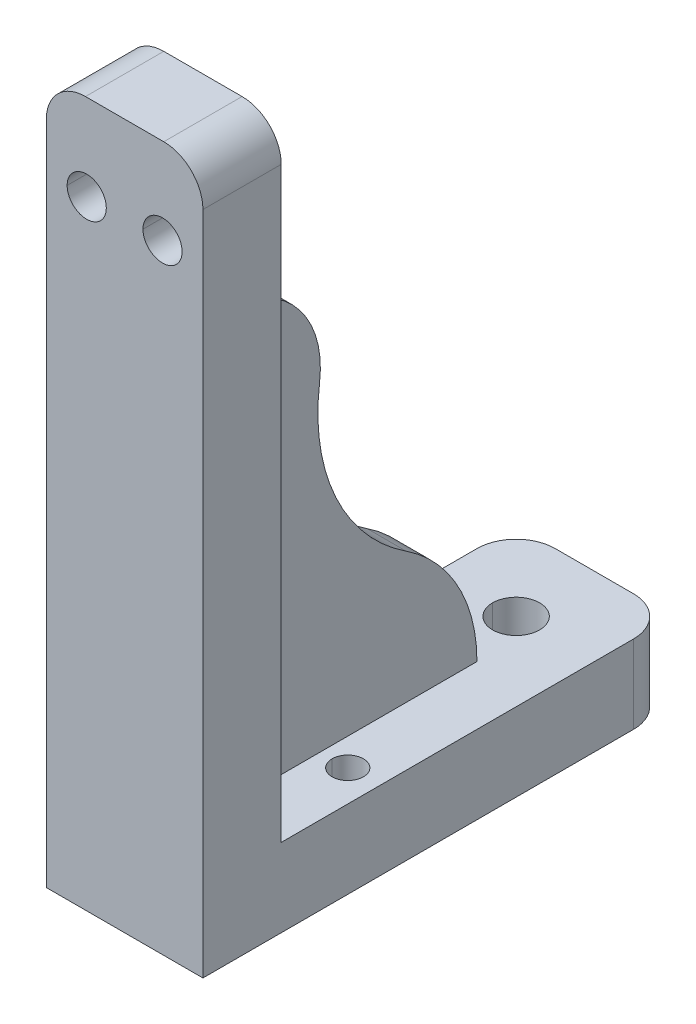
ISO-10303-21;
HEADER;
FILE_DESCRIPTION(('STEP AP214'),'2;1');
FILE_NAME('part.step','',(''),(''),'','','');
FILE_SCHEMA(('AUTOMOTIVE_DESIGN { 1 0 10303 214 1 1 1 1 }'));
ENDSEC;
DATA;
#1=APPLICATION_CONTEXT('core data for automotive mechanical design processes');
#2=APPLICATION_PROTOCOL_DEFINITION('international standard','automotive_design',2000,#1);
#3=PRODUCT_CONTEXT('',#1,'mechanical');
#4=PRODUCT('Part','Part','',(#3));
#5=PRODUCT_RELATED_PRODUCT_CATEGORY('part','',(#4));
#6=PRODUCT_DEFINITION_FORMATION('','',#4);
#7=PRODUCT_DEFINITION_CONTEXT('part definition',#1,'design');
#8=PRODUCT_DEFINITION('design','',#6,#7);
#9=PRODUCT_DEFINITION_SHAPE('','',#8);
#10=(LENGTH_UNIT() NAMED_UNIT(*) SI_UNIT(.MILLI.,.METRE.));
#11=(NAMED_UNIT(*) PLANE_ANGLE_UNIT() SI_UNIT($,.RADIAN.));
#12=(NAMED_UNIT(*) SI_UNIT($,.STERADIAN.) SOLID_ANGLE_UNIT());
#13=UNCERTAINTY_MEASURE_WITH_UNIT(LENGTH_MEASURE(1.E-05),#10,'distance_accuracy_value','');
#14=(GEOMETRIC_REPRESENTATION_CONTEXT(3) GLOBAL_UNCERTAINTY_ASSIGNED_CONTEXT((#13)) GLOBAL_UNIT_ASSIGNED_CONTEXT((#10,
#11,#12)) REPRESENTATION_CONTEXT('',''));
#15=CARTESIAN_POINT('',(0.,0.,0.));
#16=DIRECTION('',(0.,0.,1.));
#17=DIRECTION('',(1.,0.,0.));
#18=AXIS2_PLACEMENT_3D('',#15,#16,#17);
#19=CARTESIAN_POINT('',(20.,0.,0.));
#20=DIRECTION('',(1.,0.,0.));
#21=DIRECTION('',(0.,1.,0.));
#22=AXIS2_PLACEMENT_3D('',#19,#20,#21);
#23=PLANE('',#22);
#24=DIRECTION('',(0.,-1.,0.));
#25=VECTOR('',#24,1.);
#26=CARTESIAN_POINT('',(20.,85.,120.));
#27=LINE('',#26,#25);
#28=CARTESIAN_POINT('',(20.,170.,120.));
#29=VERTEX_POINT('',#28);
#30=CARTESIAN_POINT('',(20.,0.,120.));
#31=VERTEX_POINT('',#30);
#32=EDGE_CURVE('E278',#29,#31,#27,.T.);
#33=ORIENTED_EDGE('',*,*,#32,.T.);
#34=DIRECTION('',(0.,0.,-1.));
#35=VECTOR('',#34,1.);
#36=CARTESIAN_POINT('',(20.,0.,65.));
#37=LINE('',#36,#35);
#38=CARTESIAN_POINT('',(20.,0.,10.));
#39=VERTEX_POINT('',#38);
#40=EDGE_CURVE('E403',#31,#39,#37,.T.);
#41=ORIENTED_EDGE('',*,*,#40,.T.);
#42=DIRECTION('',(0.,1.,0.));
#43=VECTOR('',#42,1.);
#44=CARTESIAN_POINT('',(20.,90.,10.));
#45=LINE('',#44,#43);
#46=CARTESIAN_POINT('',(20.,20.,10.));
#47=VERTEX_POINT('',#46);
#48=EDGE_CURVE('E357',#39,#47,#45,.T.);
#49=ORIENTED_EDGE('',*,*,#48,.T.);
#50=DIRECTION('',(0.,0.,1.));
#51=VECTOR('',#50,1.);
#52=CARTESIAN_POINT('',(20.,20.,55.));
#53=LINE('',#52,#51);
#54=CARTESIAN_POINT('',(20.,20.,100.));
#55=VERTEX_POINT('',#54);
#56=EDGE_CURVE('E37',#47,#55,#53,.T.);
#57=ORIENTED_EDGE('',*,*,#56,.T.);
#58=DIRECTION('',(0.,1.,0.));
#59=VECTOR('',#58,1.);
#60=CARTESIAN_POINT('',(20.,95.,100.));
#61=LINE('',#60,#59);
#62=CARTESIAN_POINT('',(20.,170.,100.));
#63=VERTEX_POINT('',#62);
#64=EDGE_CURVE('E286',#55,#63,#61,.T.);
#65=ORIENTED_EDGE('',*,*,#64,.T.);
#66=DIRECTION('',(0.,0.,1.));
#67=VECTOR('',#66,1.);
#68=CARTESIAN_POINT('',(20.,170.,65.));
#69=LINE('',#68,#67);
#70=EDGE_CURVE('E10',#63,#29,#69,.T.);
#71=ORIENTED_EDGE('',*,*,#70,.T.);
#72=EDGE_LOOP('',(#33,#41,#49,#57,#65,#71));
#73=FACE_BOUND('',#72,.T.);
#74=ADVANCED_FACE('F17',(#73),#23,.T.);
#75=CARTESIAN_POINT('',(10.,170.,65.));
#76=DIRECTION('',(0.,0.,1.));
#77=DIRECTION('',(1.,0.,0.));
#78=AXIS2_PLACEMENT_3D('',#75,#76,#77);
#79=CYLINDRICAL_SURFACE('',#78,10.);
#80=CARTESIAN_POINT('',(10.,170.,120.));
#81=DIRECTION('',(0.,0.,-1.));
#82=DIRECTION('',(1.,0.,0.));
#83=AXIS2_PLACEMENT_3D('',#80,#81,#82);
#84=CIRCLE('',#83,10.);
#85=CARTESIAN_POINT('',(10.,180.,120.));
#86=VERTEX_POINT('',#85);
#87=EDGE_CURVE('E276',#86,#29,#84,.T.);
#88=ORIENTED_EDGE('',*,*,#87,.T.);
#89=ORIENTED_EDGE('',*,*,#70,.F.);
#90=CARTESIAN_POINT('',(10.,170.,100.));
#91=DIRECTION('',(0.,0.,1.));
#92=DIRECTION('',(1.,0.,0.));
#93=AXIS2_PLACEMENT_3D('',#90,#91,#92);
#94=CIRCLE('',#93,10.);
#95=CARTESIAN_POINT('',(10.,180.,100.));
#96=VERTEX_POINT('',#95);
#97=EDGE_CURVE('E291',#63,#96,#94,.T.);
#98=ORIENTED_EDGE('',*,*,#97,.T.);
#99=DIRECTION('',(0.,0.,1.));
#100=VECTOR('',#99,1.);
#101=CARTESIAN_POINT('',(10.,180.,110.));
#102=LINE('',#101,#100);
#103=EDGE_CURVE('E25',#96,#86,#102,.T.);
#104=ORIENTED_EDGE('',*,*,#103,.T.);
#105=EDGE_LOOP('',(#88,#89,#98,#104));
#106=FACE_BOUND('',#105,.T.);
#107=ADVANCED_FACE('F526',(#106),#79,.T.);
#108=CARTESIAN_POINT('',(0.,180.,100.));
#109=DIRECTION('',(0.,1.,0.));
#110=DIRECTION('',(1.,0.,0.));
#111=AXIS2_PLACEMENT_3D('',#108,#109,#110);
#112=PLANE('',#111);
#113=DIRECTION('',(1.,0.,0.));
#114=VECTOR('',#113,1.);
#115=CARTESIAN_POINT('',(0.,180.,120.));
#116=LINE('',#115,#114);
#117=CARTESIAN_POINT('',(-10.,180.,120.));
#118=VERTEX_POINT('',#117);
#119=EDGE_CURVE('E270',#118,#86,#116,.T.);
#120=ORIENTED_EDGE('',*,*,#119,.T.);
#121=ORIENTED_EDGE('',*,*,#103,.F.);
#122=DIRECTION('',(1.,0.,0.));
#123=VECTOR('',#122,1.);
#124=CARTESIAN_POINT('',(0.,180.,100.));
#125=LINE('',#124,#123);
#126=CARTESIAN_POINT('',(-10.,180.,100.));
#127=VERTEX_POINT('',#126);
#128=EDGE_CURVE('E258',#127,#96,#125,.T.);
#129=ORIENTED_EDGE('',*,*,#128,.F.);
#130=DIRECTION('',(0.,0.,1.));
#131=VECTOR('',#130,1.);
#132=CARTESIAN_POINT('',(-10.,180.,65.));
#133=LINE('',#132,#131);
#134=EDGE_CURVE('E250',#127,#118,#133,.T.);
#135=ORIENTED_EDGE('',*,*,#134,.T.);
#136=EDGE_LOOP('',(#120,#121,#129,#135));
#137=FACE_BOUND('',#136,.T.);
#138=ADVANCED_FACE('F523',(#137),#112,.T.);
#139=CARTESIAN_POINT('',(-10.,170.,65.));
#140=DIRECTION('',(0.,0.,1.));
#141=DIRECTION('',(0.,1.,0.));
#142=AXIS2_PLACEMENT_3D('',#139,#140,#141);
#143=CYLINDRICAL_SURFACE('',#142,10.);
#144=CARTESIAN_POINT('',(-10.,170.,120.));
#145=DIRECTION('',(0.,0.,-1.));
#146=DIRECTION('',(1.,0.,0.));
#147=AXIS2_PLACEMENT_3D('',#144,#145,#146);
#148=CIRCLE('',#147,10.);
#149=CARTESIAN_POINT('',(-20.,170.,120.));
#150=VERTEX_POINT('',#149);
#151=EDGE_CURVE('E263',#150,#118,#148,.T.);
#152=ORIENTED_EDGE('',*,*,#151,.T.);
#153=ORIENTED_EDGE('',*,*,#134,.F.);
#154=CARTESIAN_POINT('',(-10.,170.,100.));
#155=DIRECTION('',(0.,0.,1.));
#156=DIRECTION('',(1.,0.,0.));
#157=AXIS2_PLACEMENT_3D('',#154,#155,#156);
#158=CIRCLE('',#157,10.);
#159=CARTESIAN_POINT('',(-20.,170.,100.));
#160=VERTEX_POINT('',#159);
#161=EDGE_CURVE('E342',#127,#160,#158,.T.);
#162=ORIENTED_EDGE('',*,*,#161,.T.);
#163=DIRECTION('',(0.,0.,1.));
#164=VECTOR('',#163,1.);
#165=CARTESIAN_POINT('',(-20.,170.,110.));
#166=LINE('',#165,#164);
#167=EDGE_CURVE('E363',#160,#150,#166,.T.);
#168=ORIENTED_EDGE('',*,*,#167,.T.);
#169=EDGE_LOOP('',(#152,#153,#162,#168));
#170=FACE_BOUND('',#169,.T.);
#171=ADVANCED_FACE('F555',(#170),#143,.T.);
#172=CARTESIAN_POINT('',(-9.68416595459,158.,59.3399999982));
#173=DIRECTION('',(0.,0.,1.));
#174=DIRECTION('',(1.,0.,0.));
#175=AXIS2_PLACEMENT_3D('',#172,#173,#174);
#176=CYLINDRICAL_SURFACE('',#175,5.);
#177=CARTESIAN_POINT('',(-9.68416595459,158.,100.));
#178=DIRECTION('',(0.,0.,-1.));
#179=DIRECTION('',(1.,0.,0.));
#180=AXIS2_PLACEMENT_3D('',#177,#178,#179);
#181=CIRCLE('',#180,5.);
#182=CARTESIAN_POINT('',(-14.6841659546,158.,100.));
#183=VERTEX_POINT('',#182);
#184=CARTESIAN_POINT('',(-4.68416595459,158.,100.));
#185=VERTEX_POINT('',#184);
#186=EDGE_CURVE('E245',#183,#185,#181,.T.);
#187=ORIENTED_EDGE('',*,*,#186,.T.);
#188=DIRECTION('',(0.,0.,-1.));
#189=VECTOR('',#188,1.);
#190=CARTESIAN_POINT('',(-4.68416595459,158.,59.3399999982));
#191=LINE('',#190,#189);
#192=CARTESIAN_POINT('',(-4.68416595459,158.,120.));
#193=VERTEX_POINT('',#192);
#194=EDGE_CURVE('E239',#193,#185,#191,.T.);
#195=ORIENTED_EDGE('',*,*,#194,.F.);
#196=CARTESIAN_POINT('',(-9.68416595459,158.,120.));
#197=DIRECTION('',(0.,0.,1.));
#198=DIRECTION('',(1.,0.,0.));
#199=AXIS2_PLACEMENT_3D('',#196,#197,#198);
#200=CIRCLE('',#199,5.);
#201=CARTESIAN_POINT('',(-14.6841659546,158.,120.));
#202=VERTEX_POINT('',#201);
#203=EDGE_CURVE('E243',#193,#202,#200,.T.);
#204=ORIENTED_EDGE('',*,*,#203,.T.);
#205=DIRECTION('',(0.,0.,-1.));
#206=VECTOR('',#205,1.);
#207=CARTESIAN_POINT('',(-14.6841659546,158.,59.3399999982));
#208=LINE('',#207,#206);
#209=EDGE_CURVE('E251',#202,#183,#208,.T.);
#210=ORIENTED_EDGE('',*,*,#209,.T.);
#211=EDGE_LOOP('',(#187,#195,#204,#210));
#212=FACE_BOUND('',#211,.T.);
#213=ADVANCED_FACE('F241',(#212),#176,.F.);
#214=CARTESIAN_POINT('',(-9.68416595459,158.,59.3399999982));
#215=DIRECTION('',(0.,0.,1.));
#216=DIRECTION('',(1.,0.,0.));
#217=AXIS2_PLACEMENT_3D('',#214,#215,#216);
#218=CYLINDRICAL_SURFACE('',#217,5.);
#219=CARTESIAN_POINT('',(-9.68416595459,158.,100.));
#220=DIRECTION('',(0.,0.,-1.));
#221=DIRECTION('',(1.,0.,0.));
#222=AXIS2_PLACEMENT_3D('',#219,#220,#221);
#223=CIRCLE('',#222,5.);
#224=EDGE_CURVE('E356',#185,#183,#223,.T.);
#225=ORIENTED_EDGE('',*,*,#224,.T.);
#226=ORIENTED_EDGE('',*,*,#209,.F.);
#227=CARTESIAN_POINT('',(-9.68416595459,158.,120.));
#228=DIRECTION('',(0.,0.,1.));
#229=DIRECTION('',(1.,0.,0.));
#230=AXIS2_PLACEMENT_3D('',#227,#228,#229);
#231=CIRCLE('',#230,5.);
#232=EDGE_CURVE('E254',#202,#193,#231,.T.);
#233=ORIENTED_EDGE('',*,*,#232,.T.);
#234=ORIENTED_EDGE('',*,*,#194,.T.);
#235=EDGE_LOOP('',(#225,#226,#233,#234));
#236=FACE_BOUND('',#235,.T.);
#237=ADVANCED_FACE('F255',(#236),#218,.F.);
#238=CARTESIAN_POINT('',(0.,20.,0.));
#239=DIRECTION('',(0.,1.,0.));
#240=DIRECTION('',(1.,0.,0.));
#241=AXIS2_PLACEMENT_3D('',#238,#239,#240);
#242=PLANE('',#241);
#243=CARTESIAN_POINT('',(-12.,20.,75.));
#244=DIRECTION('',(0.,1.,0.));
#245=DIRECTION('',(1.,0.,0.));
#246=AXIS2_PLACEMENT_3D('',#243,#244,#245);
#247=CIRCLE('',#246,4.);
#248=CARTESIAN_POINT('',(-16.,20.,75.));
#249=VERTEX_POINT('',#248);
#250=CARTESIAN_POINT('',(-8.,20.,75.));
#251=VERTEX_POINT('',#250);
#252=EDGE_CURVE('E316',#249,#251,#247,.T.);
#253=ORIENTED_EDGE('',*,*,#252,.F.);
#254=CARTESIAN_POINT('',(-12.,20.,75.));
#255=DIRECTION('',(0.,1.,0.));
#256=DIRECTION('',(1.,0.,0.));
#257=AXIS2_PLACEMENT_3D('',#254,#255,#256);
#258=CIRCLE('',#257,4.);
#259=EDGE_CURVE('E292',#251,#249,#258,.T.);
#260=ORIENTED_EDGE('',*,*,#259,.F.);
#261=EDGE_LOOP('',(#253,#260));
#262=FACE_BOUND('',#261,.T.);
#263=CARTESIAN_POINT('',(12.,20.,75.));
#264=DIRECTION('',(0.,1.,0.));
#265=DIRECTION('',(1.,0.,0.));
#266=AXIS2_PLACEMENT_3D('',#263,#264,#265);
#267=CIRCLE('',#266,4.);
#268=CARTESIAN_POINT('',(8.,20.,75.));
#269=VERTEX_POINT('',#268);
#270=CARTESIAN_POINT('',(16.,20.,75.));
#271=VERTEX_POINT('',#270);
#272=EDGE_CURVE('E341',#269,#271,#267,.T.);
#273=ORIENTED_EDGE('',*,*,#272,.F.);
#274=CARTESIAN_POINT('',(12.,20.,75.));
#275=DIRECTION('',(0.,1.,0.));
#276=DIRECTION('',(1.,0.,0.));
#277=AXIS2_PLACEMENT_3D('',#274,#275,#276);
#278=CIRCLE('',#277,4.);
#279=EDGE_CURVE('E430',#271,#269,#278,.T.);
#280=ORIENTED_EDGE('',*,*,#279,.F.);
#281=EDGE_LOOP('',(#273,#280));
#282=FACE_BOUND('',#281,.T.);
#283=CARTESIAN_POINT('',(0.,20.,20.));
#284=DIRECTION('',(0.,1.,0.));
#285=DIRECTION('',(1.,0.,0.));
#286=AXIS2_PLACEMENT_3D('',#283,#284,#285);
#287=CIRCLE('',#286,6.);
#288=CARTESIAN_POINT('',(-6.,20.,20.));
#289=VERTEX_POINT('',#288);
#290=CARTESIAN_POINT('',(6.,20.,20.));
#291=VERTEX_POINT('',#290);
#292=EDGE_CURVE('E46',#289,#291,#287,.T.);
#293=ORIENTED_EDGE('',*,*,#292,.F.);
#294=CARTESIAN_POINT('',(0.,20.,20.));
#295=DIRECTION('',(0.,1.,0.));
#296=DIRECTION('',(1.,0.,0.));
#297=AXIS2_PLACEMENT_3D('',#294,#295,#296);
#298=CIRCLE('',#297,6.);
#299=EDGE_CURVE('E340',#291,#289,#298,.T.);
#300=ORIENTED_EDGE('',*,*,#299,.F.);
#301=EDGE_LOOP('',(#293,#300));
#302=FACE_BOUND('',#301,.T.);
#303=DIRECTION('',(0.,0.,1.));
#304=VECTOR('',#303,1.);
#305=CARTESIAN_POINT('',(-20.,20.,55.));
#306=LINE('',#305,#304);
#307=CARTESIAN_POINT('',(-20.,20.,10.));
#308=VERTEX_POINT('',#307);
#309=CARTESIAN_POINT('',(-20.,20.,100.));
#310=VERTEX_POINT('',#309);
#311=EDGE_CURVE('E368',#308,#310,#306,.T.);
#312=ORIENTED_EDGE('',*,*,#311,.T.);
#313=DIRECTION('',(1.,0.,0.));
#314=VECTOR('',#313,1.);
#315=CARTESIAN_POINT('',(-12.5,20.,100.));
#316=LINE('',#315,#314);
#317=CARTESIAN_POINT('',(-5.,20.,100.));
#318=VERTEX_POINT('',#317);
#319=EDGE_CURVE('E332',#310,#318,#316,.T.);
#320=ORIENTED_EDGE('',*,*,#319,.T.);
#321=DIRECTION('',(0.,0.,-1.));
#322=VECTOR('',#321,1.);
#323=CARTESIAN_POINT('',(-5.,20.,67.5));
#324=LINE('',#323,#322);
#325=CARTESIAN_POINT('',(-5.,20.,35.));
#326=VERTEX_POINT('',#325);
#327=EDGE_CURVE('E399',#318,#326,#324,.T.);
#328=ORIENTED_EDGE('',*,*,#327,.T.);
#329=DIRECTION('',(1.,0.,0.));
#330=VECTOR('',#329,1.);
#331=CARTESIAN_POINT('',(0.,20.,35.));
#332=LINE('',#331,#330);
#333=CARTESIAN_POINT('',(5.,20.,35.));
#334=VERTEX_POINT('',#333);
#335=EDGE_CURVE('E390',#326,#334,#332,.T.);
#336=ORIENTED_EDGE('',*,*,#335,.T.);
#337=DIRECTION('',(0.,0.,-1.));
#338=VECTOR('',#337,1.);
#339=CARTESIAN_POINT('',(5.,20.,67.5));
#340=LINE('',#339,#338);
#341=CARTESIAN_POINT('',(5.,20.,100.));
#342=VERTEX_POINT('',#341);
#343=EDGE_CURVE('E314',#342,#334,#340,.T.);
#344=ORIENTED_EDGE('',*,*,#343,.F.);
#345=DIRECTION('',(1.,0.,0.));
#346=VECTOR('',#345,1.);
#347=CARTESIAN_POINT('',(12.5,20.,100.));
#348=LINE('',#347,#346);
#349=EDGE_CURVE('E290',#342,#55,#348,.T.);
#350=ORIENTED_EDGE('',*,*,#349,.T.);
#351=ORIENTED_EDGE('',*,*,#56,.F.);
#352=CARTESIAN_POINT('',(10.,20.,10.));
#353=DIRECTION('',(0.,-1.,0.));
#354=DIRECTION('',(1.,0.,0.));
#355=AXIS2_PLACEMENT_3D('',#352,#353,#354);
#356=CIRCLE('',#355,10.);
#357=CARTESIAN_POINT('',(10.,20.,0.));
#358=VERTEX_POINT('',#357);
#359=EDGE_CURVE('E360',#358,#47,#356,.T.);
#360=ORIENTED_EDGE('',*,*,#359,.F.);
#361=DIRECTION('',(1.,0.,0.));
#362=VECTOR('',#361,1.);
#363=CARTESIAN_POINT('',(0.,20.,0.));
#364=LINE('',#363,#362);
#365=CARTESIAN_POINT('',(-10.,20.,0.));
#366=VERTEX_POINT('',#365);
#367=EDGE_CURVE('E280',#366,#358,#364,.T.);
#368=ORIENTED_EDGE('',*,*,#367,.F.);
#369=CARTESIAN_POINT('',(-10.,20.,10.));
#370=DIRECTION('',(0.,-1.,0.));
#371=DIRECTION('',(1.,0.,0.));
#372=AXIS2_PLACEMENT_3D('',#369,#370,#371);
#373=CIRCLE('',#372,10.);
#374=EDGE_CURVE('E315',#308,#366,#373,.T.);
#375=ORIENTED_EDGE('',*,*,#374,.F.);
#376=EDGE_LOOP('',(#312,#320,#328,#336,#344,#350,#351,#360,#368,#375));
#377=FACE_BOUND('',#376,.T.);
#378=ADVANCED_FACE('F532',(#262,#282,#302,#377),#242,.T.);
#379=CARTESIAN_POINT('',(5.,0.,0.));
#380=DIRECTION('',(1.,0.,0.));
#381=DIRECTION('',(0.,1.,0.));
#382=AXIS2_PLACEMENT_3D('',#379,#380,#381);
#383=PLANE('',#382);
#384=CARTESIAN_POINT('',(5.,20.,75.));
#385=DIRECTION('',(1.,0.,0.));
#386=DIRECTION('',(0.,1.,0.));
#387=AXIS2_PLACEMENT_3D('',#384,#385,#386);
#388=CIRCLE('',#387,40.);
#389=CARTESIAN_POINT('',(5.,53.4462866508,53.0604031652));
#390=VERTEX_POINT('',#389);
#391=EDGE_CURVE('E394',#334,#390,#388,.T.);
#392=ORIENTED_EDGE('',*,*,#391,.T.);
#393=CARTESIAN_POINT('',(5.,95.2541449642,25.6359071216));
#394=DIRECTION('',(-1.,0.,0.));
#395=DIRECTION('',(0.,1.,0.));
#396=AXIS2_PLACEMENT_3D('',#393,#394,#395);
#397=CIRCLE('',#396,50.);
#398=CARTESIAN_POINT('',(5.,101.751381655,75.2119690405));
#399=VERTEX_POINT('',#398);
#400=EDGE_CURVE('E377',#390,#399,#397,.T.);
#401=ORIENTED_EDGE('',*,*,#400,.T.);
#402=CARTESIAN_POINT('',(5.,105.,100.));
#403=DIRECTION('',(1.,0.,0.));
#404=DIRECTION('',(0.,1.,0.));
#405=AXIS2_PLACEMENT_3D('',#402,#403,#404);
#406=CIRCLE('',#405,25.);
#407=CARTESIAN_POINT('',(5.,130.,100.));
#408=VERTEX_POINT('',#407);
#409=EDGE_CURVE('E311',#399,#408,#406,.T.);
#410=ORIENTED_EDGE('',*,*,#409,.T.);
#411=DIRECTION('',(0.,-1.,0.));
#412=VECTOR('',#411,1.);
#413=CARTESIAN_POINT('',(5.,75.,100.));
#414=LINE('',#413,#412);
#415=EDGE_CURVE('E306',#408,#342,#414,.T.);
#416=ORIENTED_EDGE('',*,*,#415,.T.);
#417=ORIENTED_EDGE('',*,*,#343,.T.);
#418=EDGE_LOOP('',(#392,#401,#410,#416,#417));
#419=FACE_BOUND('',#418,.T.);
#420=ADVANCED_FACE('F535',(#419),#383,.T.);
#421=CARTESIAN_POINT('',(0.,105.,100.));
#422=DIRECTION('',(1.,0.,0.));
#423=DIRECTION('',(0.,-0.129944733810026,-0.991521238378201));
#424=AXIS2_PLACEMENT_3D('',#421,#422,#423);
#425=CYLINDRICAL_SURFACE('',#424,25.);
#426=DIRECTION('',(1.,0.,0.));
#427=VECTOR('',#426,1.);
#428=CARTESIAN_POINT('',(0.,101.751381655,75.2119690405));
#429=LINE('',#428,#427);
#430=CARTESIAN_POINT('',(-5.,101.751381655,75.2119690405));
#431=VERTEX_POINT('',#430);
#432=EDGE_CURVE('E353',#431,#399,#429,.T.);
#433=ORIENTED_EDGE('',*,*,#432,.F.);
#434=CARTESIAN_POINT('',(-5.,105.,100.));
#435=DIRECTION('',(1.,0.,0.));
#436=DIRECTION('',(0.,1.,0.));
#437=AXIS2_PLACEMENT_3D('',#434,#435,#436);
#438=CIRCLE('',#437,25.);
#439=CARTESIAN_POINT('',(-5.,130.,100.));
#440=VERTEX_POINT('',#439);
#441=EDGE_CURVE('E395',#431,#440,#438,.T.);
#442=ORIENTED_EDGE('',*,*,#441,.T.);
#443=DIRECTION('',(1.,0.,0.));
#444=VECTOR('',#443,1.);
#445=CARTESIAN_POINT('',(0.,130.,100.));
#446=LINE('',#445,#444);
#447=EDGE_CURVE('E310',#440,#408,#446,.T.);
#448=ORIENTED_EDGE('',*,*,#447,.T.);
#449=ORIENTED_EDGE('',*,*,#409,.F.);
#450=EDGE_LOOP('',(#433,#442,#448,#449));
#451=FACE_BOUND('',#450,.T.);
#452=ADVANCED_FACE('F538',(#451),#425,.T.);
#453=CARTESIAN_POINT('',(-10.,90.,10.));
#454=DIRECTION('',(0.,1.,0.));
#455=DIRECTION('',(0.,0.,-1.));
#456=AXIS2_PLACEMENT_3D('',#453,#454,#455);
#457=CYLINDRICAL_SURFACE('',#456,10.);
#458=ORIENTED_EDGE('',*,*,#374,.T.);
#459=DIRECTION('',(0.,1.,0.));
#460=VECTOR('',#459,1.);
#461=CARTESIAN_POINT('',(-10.,10.,0.));
#462=LINE('',#461,#460);
#463=CARTESIAN_POINT('',(-10.,0.,0.));
#464=VERTEX_POINT('',#463);
#465=EDGE_CURVE('E274',#464,#366,#462,.T.);
#466=ORIENTED_EDGE('',*,*,#465,.F.);
#467=CARTESIAN_POINT('',(-10.,0.,10.));
#468=DIRECTION('',(0.,1.,0.));
#469=DIRECTION('',(1.,0.,0.));
#470=AXIS2_PLACEMENT_3D('',#467,#468,#469);
#471=CIRCLE('',#470,10.);
#472=CARTESIAN_POINT('',(-20.,0.,10.));
#473=VERTEX_POINT('',#472);
#474=EDGE_CURVE('E409',#464,#473,#471,.T.);
#475=ORIENTED_EDGE('',*,*,#474,.T.);
#476=DIRECTION('',(0.,1.,0.));
#477=VECTOR('',#476,1.);
#478=CARTESIAN_POINT('',(-20.,10.,10.));
#479=LINE('',#478,#477);
#480=EDGE_CURVE('E371',#473,#308,#479,.T.);
#481=ORIENTED_EDGE('',*,*,#480,.T.);
#482=EDGE_LOOP('',(#458,#466,#475,#481));
#483=FACE_BOUND('',#482,.T.);
#484=ADVANCED_FACE('F572',(#483),#457,.T.);
#485=CARTESIAN_POINT('',(10.,90.,10.));
#486=DIRECTION('',(0.,1.,0.));
#487=DIRECTION('',(1.,0.,0.));
#488=AXIS2_PLACEMENT_3D('',#485,#486,#487);
#489=CYLINDRICAL_SURFACE('',#488,10.);
#490=ORIENTED_EDGE('',*,*,#359,.T.);
#491=ORIENTED_EDGE('',*,*,#48,.F.);
#492=CARTESIAN_POINT('',(10.,0.,10.));
#493=DIRECTION('',(0.,1.,0.));
#494=DIRECTION('',(1.,0.,0.));
#495=AXIS2_PLACEMENT_3D('',#492,#493,#494);
#496=CIRCLE('',#495,10.);
#497=CARTESIAN_POINT('',(10.,0.,0.));
#498=VERTEX_POINT('',#497);
#499=EDGE_CURVE('E389',#39,#498,#496,.T.);
#500=ORIENTED_EDGE('',*,*,#499,.T.);
#501=DIRECTION('',(0.,1.,0.));
#502=VECTOR('',#501,1.);
#503=CARTESIAN_POINT('',(10.,10.,0.));
#504=LINE('',#503,#502);
#505=EDGE_CURVE('E284',#498,#358,#504,.T.);
#506=ORIENTED_EDGE('',*,*,#505,.T.);
#507=EDGE_LOOP('',(#490,#491,#500,#506));
#508=FACE_BOUND('',#507,.T.);
#509=ADVANCED_FACE('F564',(#508),#489,.T.);
#510=CARTESIAN_POINT('',(0.,9.33999999889,20.));
#511=DIRECTION('',(0.,1.,0.));
#512=DIRECTION('',(-1.,0.,0.));
#513=AXIS2_PLACEMENT_3D('',#510,#511,#512);
#514=CYLINDRICAL_SURFACE('',#513,6.);
#515=CARTESIAN_POINT('',(0.,0.,20.));
#516=DIRECTION('',(0.,-1.,0.));
#517=DIRECTION('',(1.,0.,0.));
#518=AXIS2_PLACEMENT_3D('',#515,#516,#517);
#519=CIRCLE('',#518,6.);
#520=CARTESIAN_POINT('',(6.,0.,20.));
#521=VERTEX_POINT('',#520);
#522=CARTESIAN_POINT('',(-6.,0.,20.));
#523=VERTEX_POINT('',#522);
#524=EDGE_CURVE('E324',#521,#523,#519,.T.);
#525=ORIENTED_EDGE('',*,*,#524,.T.);
#526=DIRECTION('',(0.,-1.,0.));
#527=VECTOR('',#526,1.);
#528=CARTESIAN_POINT('',(-6.,9.33999999889,20.));
#529=LINE('',#528,#527);
#530=EDGE_CURVE('E434',#289,#523,#529,.T.);
#531=ORIENTED_EDGE('',*,*,#530,.F.);
#532=ORIENTED_EDGE('',*,*,#292,.T.);
#533=DIRECTION('',(0.,-1.,0.));
#534=VECTOR('',#533,1.);
#535=CARTESIAN_POINT('',(6.,9.33999999889,20.));
#536=LINE('',#535,#534);
#537=EDGE_CURVE('E337',#291,#521,#536,.T.);
#538=ORIENTED_EDGE('',*,*,#537,.T.);
#539=EDGE_LOOP('',(#525,#531,#532,#538));
#540=FACE_BOUND('',#539,.T.);
#541=ADVANCED_FACE('F580',(#540),#514,.F.);
#542=CARTESIAN_POINT('',(0.,9.33999999889,20.));
#543=DIRECTION('',(0.,1.,0.));
#544=DIRECTION('',(-1.,0.,0.));
#545=AXIS2_PLACEMENT_3D('',#542,#543,#544);
#546=CYLINDRICAL_SURFACE('',#545,6.);
#547=CARTESIAN_POINT('',(0.,0.,20.));
#548=DIRECTION('',(0.,-1.,0.));
#549=DIRECTION('',(1.,0.,0.));
#550=AXIS2_PLACEMENT_3D('',#547,#548,#549);
#551=CIRCLE('',#550,6.);
#552=EDGE_CURVE('E320',#523,#521,#551,.T.);
#553=ORIENTED_EDGE('',*,*,#552,.T.);
#554=ORIENTED_EDGE('',*,*,#537,.F.);
#555=ORIENTED_EDGE('',*,*,#299,.T.);
#556=ORIENTED_EDGE('',*,*,#530,.T.);
#557=EDGE_LOOP('',(#553,#554,#555,#556));
#558=FACE_BOUND('',#557,.T.);
#559=ADVANCED_FACE('F604',(#558),#546,.F.);
#560=CARTESIAN_POINT('',(12.,9.33999999889,75.));
#561=DIRECTION('',(0.,1.,0.));
#562=DIRECTION('',(-1.,0.,0.));
#563=AXIS2_PLACEMENT_3D('',#560,#561,#562);
#564=CYLINDRICAL_SURFACE('',#563,4.);
#565=CARTESIAN_POINT('',(12.,0.,75.));
#566=DIRECTION('',(0.,-1.,0.));
#567=DIRECTION('',(1.,0.,0.));
#568=AXIS2_PLACEMENT_3D('',#565,#566,#567);
#569=CIRCLE('',#568,4.);
#570=CARTESIAN_POINT('',(16.,0.,75.));
#571=VERTEX_POINT('',#570);
#572=CARTESIAN_POINT('',(8.,0.,75.));
#573=VERTEX_POINT('',#572);
#574=EDGE_CURVE('E303',#571,#573,#569,.T.);
#575=ORIENTED_EDGE('',*,*,#574,.T.);
#576=DIRECTION('',(0.,-1.,0.));
#577=VECTOR('',#576,1.);
#578=CARTESIAN_POINT('',(8.,9.33999999889,75.));
#579=LINE('',#578,#577);
#580=EDGE_CURVE('E417',#269,#573,#579,.T.);
#581=ORIENTED_EDGE('',*,*,#580,.F.);
#582=ORIENTED_EDGE('',*,*,#272,.T.);
#583=DIRECTION('',(0.,-1.,0.));
#584=VECTOR('',#583,1.);
#585=CARTESIAN_POINT('',(16.,9.33999999889,75.));
#586=LINE('',#585,#584);
#587=EDGE_CURVE('E319',#271,#571,#586,.T.);
#588=ORIENTED_EDGE('',*,*,#587,.T.);
#589=EDGE_LOOP('',(#575,#581,#582,#588));
#590=FACE_BOUND('',#589,.T.);
#591=ADVANCED_FACE('F607',(#590),#564,.F.);
#592=CARTESIAN_POINT('',(12.,9.33999999889,75.));
#593=DIRECTION('',(0.,1.,0.));
#594=DIRECTION('',(-1.,0.,0.));
#595=AXIS2_PLACEMENT_3D('',#592,#593,#594);
#596=CYLINDRICAL_SURFACE('',#595,4.);
#597=CARTESIAN_POINT('',(12.,0.,75.));
#598=DIRECTION('',(0.,-1.,0.));
#599=DIRECTION('',(1.,0.,0.));
#600=AXIS2_PLACEMENT_3D('',#597,#598,#599);
#601=CIRCLE('',#600,4.);
#602=EDGE_CURVE('E298',#573,#571,#601,.T.);
#603=ORIENTED_EDGE('',*,*,#602,.T.);
#604=ORIENTED_EDGE('',*,*,#587,.F.);
#605=ORIENTED_EDGE('',*,*,#279,.T.);
#606=ORIENTED_EDGE('',*,*,#580,.T.);
#607=EDGE_LOOP('',(#603,#604,#605,#606));
#608=FACE_BOUND('',#607,.T.);
#609=ADVANCED_FACE('F614',(#608),#596,.F.);
#610=CARTESIAN_POINT('',(-12.,9.33999999889,75.));
#611=DIRECTION('',(0.,1.,0.));
#612=DIRECTION('',(-1.,0.,0.));
#613=AXIS2_PLACEMENT_3D('',#610,#611,#612);
#614=CYLINDRICAL_SURFACE('',#613,4.);
#615=CARTESIAN_POINT('',(-12.,0.,75.));
#616=DIRECTION('',(0.,-1.,0.));
#617=DIRECTION('',(1.,0.,0.));
#618=AXIS2_PLACEMENT_3D('',#615,#616,#617);
#619=CIRCLE('',#618,4.);
#620=CARTESIAN_POINT('',(-8.,0.,75.));
#621=VERTEX_POINT('',#620);
#622=CARTESIAN_POINT('',(-16.,0.,75.));
#623=VERTEX_POINT('',#622);
#624=EDGE_CURVE('E302',#621,#623,#619,.T.);
#625=ORIENTED_EDGE('',*,*,#624,.T.);
#626=DIRECTION('',(0.,-1.,0.));
#627=VECTOR('',#626,1.);
#628=CARTESIAN_POINT('',(-16.,9.33999999889,75.));
#629=LINE('',#628,#627);
#630=EDGE_CURVE('E296',#249,#623,#629,.T.);
#631=ORIENTED_EDGE('',*,*,#630,.F.);
#632=ORIENTED_EDGE('',*,*,#252,.T.);
#633=DIRECTION('',(0.,-1.,0.));
#634=VECTOR('',#633,1.);
#635=CARTESIAN_POINT('',(-8.,9.33999999889,75.));
#636=LINE('',#635,#634);
#637=EDGE_CURVE('E297',#251,#621,#636,.T.);
#638=ORIENTED_EDGE('',*,*,#637,.T.);
#639=EDGE_LOOP('',(#625,#631,#632,#638));
#640=FACE_BOUND('',#639,.T.);
#641=ADVANCED_FACE('F618',(#640),#614,.F.);
#642=CARTESIAN_POINT('',(-12.,9.33999999889,75.));
#643=DIRECTION('',(0.,1.,0.));
#644=DIRECTION('',(-1.,0.,0.));
#645=AXIS2_PLACEMENT_3D('',#642,#643,#644);
#646=CYLINDRICAL_SURFACE('',#645,4.);
#647=CARTESIAN_POINT('',(-12.,0.,75.));
#648=DIRECTION('',(0.,-1.,0.));
#649=DIRECTION('',(1.,0.,0.));
#650=AXIS2_PLACEMENT_3D('',#647,#648,#649);
#651=CIRCLE('',#650,4.);
#652=EDGE_CURVE('E424',#623,#621,#651,.T.);
#653=ORIENTED_EDGE('',*,*,#652,.T.);
#654=ORIENTED_EDGE('',*,*,#637,.F.);
#655=ORIENTED_EDGE('',*,*,#259,.T.);
#656=ORIENTED_EDGE('',*,*,#630,.T.);
#657=EDGE_LOOP('',(#653,#654,#655,#656));
#658=FACE_BOUND('',#657,.T.);
#659=ADVANCED_FACE('F622',(#658),#646,.F.);
#660=CARTESIAN_POINT('',(0.,20.,75.));
#661=DIRECTION('',(1.,0.,0.));
#662=DIRECTION('',(0.,0.,-1.));
#663=AXIS2_PLACEMENT_3D('',#660,#661,#662);
#664=CYLINDRICAL_SURFACE('',#663,40.);
#665=ORIENTED_EDGE('',*,*,#335,.F.);
#666=CARTESIAN_POINT('',(-5.,20.,75.));
#667=DIRECTION('',(1.,0.,0.));
#668=DIRECTION('',(0.,1.,0.));
#669=AXIS2_PLACEMENT_3D('',#666,#667,#668);
#670=CIRCLE('',#669,40.);
#671=CARTESIAN_POINT('',(-5.,53.4462866508,53.0604031652));
#672=VERTEX_POINT('',#671);
#673=EDGE_CURVE('E285',#326,#672,#670,.T.);
#674=ORIENTED_EDGE('',*,*,#673,.T.);
#675=DIRECTION('',(1.,0.,0.));
#676=VECTOR('',#675,1.);
#677=CARTESIAN_POINT('',(0.,53.4462866508,53.0604031652));
#678=LINE('',#677,#676);
#679=EDGE_CURVE('E349',#672,#390,#678,.T.);
#680=ORIENTED_EDGE('',*,*,#679,.T.);
#681=ORIENTED_EDGE('',*,*,#391,.F.);
#682=EDGE_LOOP('',(#665,#674,#680,#681));
#683=FACE_BOUND('',#682,.T.);
#684=ADVANCED_FACE('F627',(#683),#664,.T.);
#685=CARTESIAN_POINT('',(0.,95.2541449642,25.6359071216));
#686=DIRECTION('',(1.,0.,0.));
#687=DIRECTION('',(0.,0.129944733810026,0.991521238378201));
#688=AXIS2_PLACEMENT_3D('',#685,#686,#687);
#689=CYLINDRICAL_SURFACE('',#688,50.);
#690=ORIENTED_EDGE('',*,*,#679,.F.);
#691=CARTESIAN_POINT('',(-5.,95.2541449642,25.6359071216));
#692=DIRECTION('',(-1.,0.,0.));
#693=DIRECTION('',(0.,1.,0.));
#694=AXIS2_PLACEMENT_3D('',#691,#692,#693);
#695=CIRCLE('',#694,50.);
#696=EDGE_CURVE('E398',#672,#431,#695,.T.);
#697=ORIENTED_EDGE('',*,*,#696,.T.);
#698=ORIENTED_EDGE('',*,*,#432,.T.);
#699=ORIENTED_EDGE('',*,*,#400,.F.);
#700=EDGE_LOOP('',(#690,#697,#698,#699));
#701=FACE_BOUND('',#700,.T.);
#702=ADVANCED_FACE('F624',(#701),#689,.F.);
#703=CARTESIAN_POINT('',(0.,0.,0.));
#704=DIRECTION('',(0.,0.,-1.));
#705=DIRECTION('',(0.,-1.,0.));
#706=AXIS2_PLACEMENT_3D('',#703,#704,#705);
#707=PLANE('',#706);
#708=ORIENTED_EDGE('',*,*,#367,.T.);
#709=ORIENTED_EDGE('',*,*,#505,.F.);
#710=DIRECTION('',(1.,0.,0.));
#711=VECTOR('',#710,1.);
#712=CARTESIAN_POINT('',(0.,0.,0.));
#713=LINE('',#712,#711);
#714=EDGE_CURVE('E382',#464,#498,#713,.T.);
#715=ORIENTED_EDGE('',*,*,#714,.F.);
#716=ORIENTED_EDGE('',*,*,#465,.T.);
#717=EDGE_LOOP('',(#708,#709,#715,#716));
#718=FACE_BOUND('',#717,.T.);
#719=ADVANCED_FACE('F567',(#718),#707,.T.);
#720=CARTESIAN_POINT('',(-5.,0.,0.));
#721=DIRECTION('',(1.,0.,0.));
#722=DIRECTION('',(0.,1.,0.));
#723=AXIS2_PLACEMENT_3D('',#720,#721,#722);
#724=PLANE('',#723);
#725=ORIENTED_EDGE('',*,*,#327,.F.);
#726=DIRECTION('',(0.,-1.,0.));
#727=VECTOR('',#726,1.);
#728=CARTESIAN_POINT('',(-5.,75.,100.));
#729=LINE('',#728,#727);
#730=EDGE_CURVE('E328',#440,#318,#729,.T.);
#731=ORIENTED_EDGE('',*,*,#730,.F.);
#732=ORIENTED_EDGE('',*,*,#441,.F.);
#733=ORIENTED_EDGE('',*,*,#696,.F.);
#734=ORIENTED_EDGE('',*,*,#673,.F.);
#735=EDGE_LOOP('',(#725,#731,#732,#733,#734));
#736=FACE_BOUND('',#735,.T.);
#737=ADVANCED_FACE('F543',(#736),#724,.F.);
#738=CARTESIAN_POINT('',(0.,0.,120.));
#739=DIRECTION('',(0.,-1.,0.));
#740=DIRECTION('',(0.,0.,-1.));
#741=AXIS2_PLACEMENT_3D('',#738,#739,#740);
#742=PLANE('',#741);
#743=ORIENTED_EDGE('',*,*,#624,.F.);
#744=ORIENTED_EDGE('',*,*,#652,.F.);
#745=EDGE_LOOP('',(#743,#744));
#746=FACE_BOUND('',#745,.T.);
#747=ORIENTED_EDGE('',*,*,#574,.F.);
#748=ORIENTED_EDGE('',*,*,#602,.F.);
#749=EDGE_LOOP('',(#747,#748));
#750=FACE_BOUND('',#749,.T.);
#751=ORIENTED_EDGE('',*,*,#524,.F.);
#752=ORIENTED_EDGE('',*,*,#552,.F.);
#753=EDGE_LOOP('',(#751,#752));
#754=FACE_BOUND('',#753,.T.);
#755=ORIENTED_EDGE('',*,*,#714,.T.);
#756=ORIENTED_EDGE('',*,*,#499,.F.);
#757=ORIENTED_EDGE('',*,*,#40,.F.);
#758=DIRECTION('',(1.,0.,0.));
#759=VECTOR('',#758,1.);
#760=CARTESIAN_POINT('',(0.,0.,120.));
#761=LINE('',#760,#759);
#762=CARTESIAN_POINT('',(-20.,0.,120.));
#763=VERTEX_POINT('',#762);
#764=EDGE_CURVE('E509',#763,#31,#761,.T.);
#765=ORIENTED_EDGE('',*,*,#764,.F.);
#766=DIRECTION('',(0.,0.,-1.));
#767=VECTOR('',#766,1.);
#768=CARTESIAN_POINT('',(-20.,0.,65.));
#769=LINE('',#768,#767);
#770=EDGE_CURVE('E378',#763,#473,#769,.T.);
#771=ORIENTED_EDGE('',*,*,#770,.T.);
#772=ORIENTED_EDGE('',*,*,#474,.F.);
#773=EDGE_LOOP('',(#755,#756,#757,#765,#771,#772));
#774=FACE_BOUND('',#773,.T.);
#775=ADVANCED_FACE('F560',(#746,#750,#754,#774),#742,.T.);
#776=CARTESIAN_POINT('',(-20.,0.,0.));
#777=DIRECTION('',(1.,0.,0.));
#778=DIRECTION('',(0.,1.,0.));
#779=AXIS2_PLACEMENT_3D('',#776,#777,#778);
#780=PLANE('',#779);
#781=ORIENTED_EDGE('',*,*,#167,.F.);
#782=DIRECTION('',(0.,1.,0.));
#783=VECTOR('',#782,1.);
#784=CARTESIAN_POINT('',(-20.,95.,100.));
#785=LINE('',#784,#783);
#786=EDGE_CURVE('E336',#310,#160,#785,.T.);
#787=ORIENTED_EDGE('',*,*,#786,.F.);
#788=ORIENTED_EDGE('',*,*,#311,.F.);
#789=ORIENTED_EDGE('',*,*,#480,.F.);
#790=ORIENTED_EDGE('',*,*,#770,.F.);
#791=DIRECTION('',(0.,-1.,0.));
#792=VECTOR('',#791,1.);
#793=CARTESIAN_POINT('',(-20.,85.,120.));
#794=LINE('',#793,#792);
#795=EDGE_CURVE('E505',#150,#763,#794,.T.);
#796=ORIENTED_EDGE('',*,*,#795,.F.);
#797=EDGE_LOOP('',(#781,#787,#788,#789,#790,#796));
#798=FACE_BOUND('',#797,.T.);
#799=ADVANCED_FACE('F551',(#798),#780,.F.);
#800=CARTESIAN_POINT('',(0.,20.,100.));
#801=DIRECTION('',(0.,0.,-1.));
#802=DIRECTION('',(0.,-1.,0.));
#803=AXIS2_PLACEMENT_3D('',#800,#801,#802);
#804=PLANE('',#803);
#805=ORIENTED_EDGE('',*,*,#186,.F.);
#806=ORIENTED_EDGE('',*,*,#224,.F.);
#807=EDGE_LOOP('',(#805,#806));
#808=FACE_BOUND('',#807,.T.);
#809=CARTESIAN_POINT('',(9.68416595459,158.,100.));
#810=DIRECTION('',(0.,0.,-1.));
#811=DIRECTION('',(1.,0.,0.));
#812=AXIS2_PLACEMENT_3D('',#809,#810,#811);
#813=CIRCLE('',#812,5.);
#814=CARTESIAN_POINT('',(4.68416595459,158.,100.));
#815=VERTEX_POINT('',#814);
#816=CARTESIAN_POINT('',(14.6841659546,158.,100.));
#817=VERTEX_POINT('',#816);
#818=EDGE_CURVE('E498',#815,#817,#813,.T.);
#819=ORIENTED_EDGE('',*,*,#818,.F.);
#820=CARTESIAN_POINT('',(9.68416595459,158.,100.));
#821=DIRECTION('',(0.,0.,-1.));
#822=DIRECTION('',(1.,0.,0.));
#823=AXIS2_PLACEMENT_3D('',#820,#821,#822);
#824=CIRCLE('',#823,5.);
#825=EDGE_CURVE('E476',#817,#815,#824,.T.);
#826=ORIENTED_EDGE('',*,*,#825,.F.);
#827=EDGE_LOOP('',(#819,#826));
#828=FACE_BOUND('',#827,.T.);
#829=ORIENTED_EDGE('',*,*,#128,.T.);
#830=ORIENTED_EDGE('',*,*,#97,.F.);
#831=ORIENTED_EDGE('',*,*,#64,.F.);
#832=ORIENTED_EDGE('',*,*,#349,.F.);
#833=ORIENTED_EDGE('',*,*,#415,.F.);
#834=ORIENTED_EDGE('',*,*,#447,.F.);
#835=ORIENTED_EDGE('',*,*,#730,.T.);
#836=ORIENTED_EDGE('',*,*,#319,.F.);
#837=ORIENTED_EDGE('',*,*,#786,.T.);
#838=ORIENTED_EDGE('',*,*,#161,.F.);
#839=EDGE_LOOP('',(#829,#830,#831,#832,#833,#834,#835,#836,#837,#838));
#840=FACE_BOUND('',#839,.T.);
#841=ADVANCED_FACE('F521',(#808,#828,#840),#804,.T.);
#842=CARTESIAN_POINT('',(0.,180.,120.));
#843=DIRECTION('',(0.,0.,1.));
#844=DIRECTION('',(1.,0.,0.));
#845=AXIS2_PLACEMENT_3D('',#842,#843,#844);
#846=PLANE('',#845);
#847=ORIENTED_EDGE('',*,*,#203,.F.);
#848=ORIENTED_EDGE('',*,*,#232,.F.);
#849=EDGE_LOOP('',(#847,#848));
#850=FACE_BOUND('',#849,.T.);
#851=CARTESIAN_POINT('',(9.68416595459,158.,120.));
#852=DIRECTION('',(0.,0.,1.));
#853=DIRECTION('',(1.,0.,0.));
#854=AXIS2_PLACEMENT_3D('',#851,#852,#853);
#855=CIRCLE('',#854,5.);
#856=CARTESIAN_POINT('',(14.6841659546,158.,120.));
#857=VERTEX_POINT('',#856);
#858=CARTESIAN_POINT('',(4.68416595459,158.,120.));
#859=VERTEX_POINT('',#858);
#860=EDGE_CURVE('E502',#857,#859,#855,.T.);
#861=ORIENTED_EDGE('',*,*,#860,.F.);
#862=CARTESIAN_POINT('',(9.68416595459,158.,120.));
#863=DIRECTION('',(0.,0.,1.));
#864=DIRECTION('',(1.,0.,0.));
#865=AXIS2_PLACEMENT_3D('',#862,#863,#864);
#866=CIRCLE('',#865,5.);
#867=EDGE_CURVE('E480',#859,#857,#866,.T.);
#868=ORIENTED_EDGE('',*,*,#867,.F.);
#869=EDGE_LOOP('',(#861,#868));
#870=FACE_BOUND('',#869,.T.);
#871=ORIENTED_EDGE('',*,*,#795,.T.);
#872=ORIENTED_EDGE('',*,*,#764,.T.);
#873=ORIENTED_EDGE('',*,*,#32,.F.);
#874=ORIENTED_EDGE('',*,*,#87,.F.);
#875=ORIENTED_EDGE('',*,*,#119,.F.);
#876=ORIENTED_EDGE('',*,*,#151,.F.);
#877=EDGE_LOOP('',(#871,#872,#873,#874,#875,#876));
#878=FACE_BOUND('',#877,.T.);
#879=ADVANCED_FACE('F260',(#850,#870,#878),#846,.T.);
#880=CARTESIAN_POINT('',(9.68416595459,158.,59.3399999982));
#881=DIRECTION('',(0.,0.,1.));
#882=DIRECTION('',(1.,0.,0.));
#883=AXIS2_PLACEMENT_3D('',#880,#881,#882);
#884=CYLINDRICAL_SURFACE('',#883,5.);
#885=ORIENTED_EDGE('',*,*,#818,.T.);
#886=DIRECTION('',(0.,0.,-1.));
#887=VECTOR('',#886,1.);
#888=CARTESIAN_POINT('',(14.6841659546,158.,59.3399999982));
#889=LINE('',#888,#887);
#890=EDGE_CURVE('E485',#857,#817,#889,.T.);
#891=ORIENTED_EDGE('',*,*,#890,.F.);
#892=ORIENTED_EDGE('',*,*,#860,.T.);
#893=DIRECTION('',(0.,0.,-1.));
#894=VECTOR('',#893,1.);
#895=CARTESIAN_POINT('',(4.68416595459,158.,59.3399999982));
#896=LINE('',#895,#894);
#897=EDGE_CURVE('E477',#859,#815,#896,.T.);
#898=ORIENTED_EDGE('',*,*,#897,.T.);
#899=EDGE_LOOP('',(#885,#891,#892,#898));
#900=FACE_BOUND('',#899,.T.);
#901=ADVANCED_FACE('F643',(#900),#884,.F.);
#902=CARTESIAN_POINT('',(9.68416595459,158.,59.3399999982));
#903=DIRECTION('',(0.,0.,1.));
#904=DIRECTION('',(1.,0.,0.));
#905=AXIS2_PLACEMENT_3D('',#902,#903,#904);
#906=CYLINDRICAL_SURFACE('',#905,5.);
#907=ORIENTED_EDGE('',*,*,#825,.T.);
#908=ORIENTED_EDGE('',*,*,#897,.F.);
#909=ORIENTED_EDGE('',*,*,#867,.T.);
#910=ORIENTED_EDGE('',*,*,#890,.T.);
#911=EDGE_LOOP('',(#907,#908,#909,#910));
#912=FACE_BOUND('',#911,.T.);
#913=ADVANCED_FACE('F649',(#912),#906,.F.);
#914=CLOSED_SHELL('',(#74,#107,#138,#171,#213,#237,#378,#420,#452,#484,#509,#541,#559,#591,#609,
#641,#659,#684,#702,#719,#737,#775,#799,#841,#879,#901,#913));
#915=MANIFOLD_SOLID_BREP('B1',#914);
#916=ADVANCED_BREP_SHAPE_REPRESENTATION('',(#18,#915),#14);
#917=SHAPE_DEFINITION_REPRESENTATION(#9,#916);
ENDSEC;
END-ISO-10303-21;
